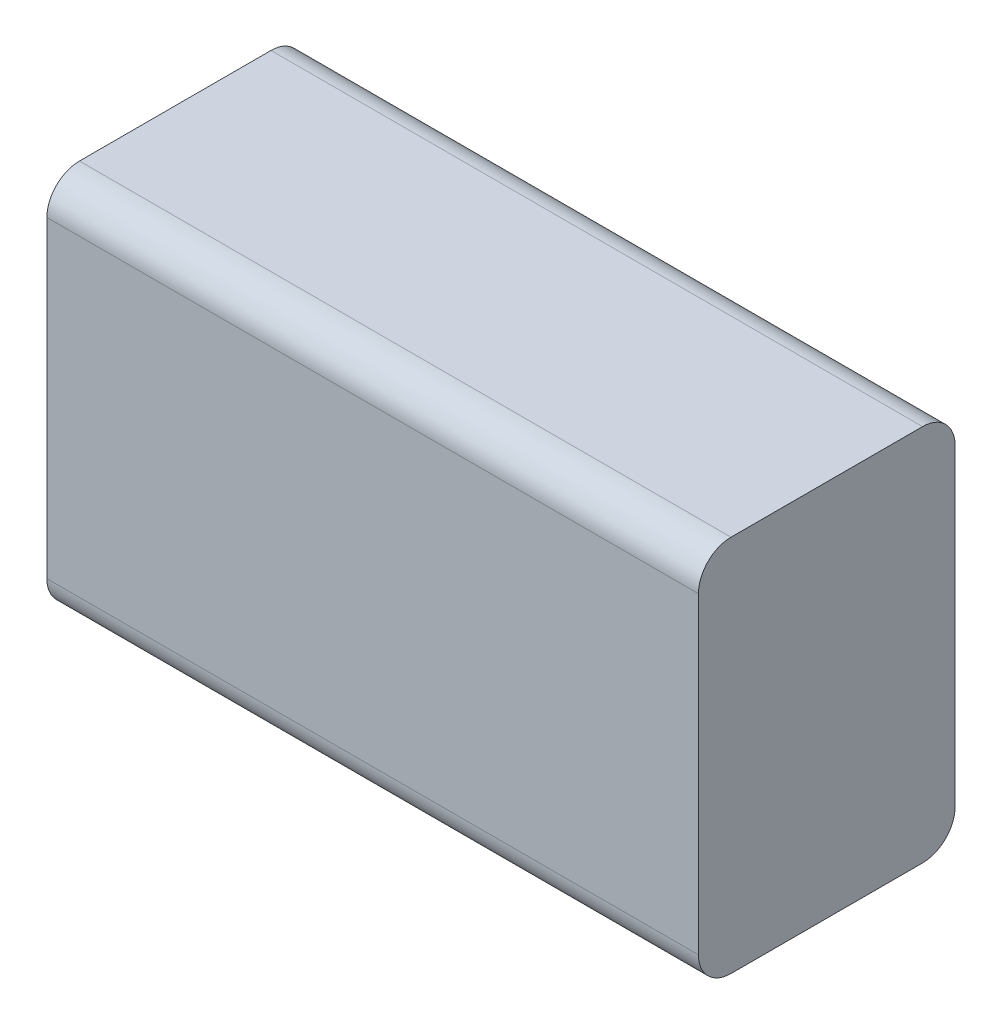
ISO-10303-21;
HEADER;
FILE_DESCRIPTION(('STEP AP214'),'2;1');
FILE_NAME('part.step','',(''),(''),'','','');
FILE_SCHEMA(('AUTOMOTIVE_DESIGN { 1 0 10303 214 1 1 1 1 }'));
ENDSEC;
DATA;
#1=APPLICATION_CONTEXT('core data for automotive mechanical design processes');
#2=APPLICATION_PROTOCOL_DEFINITION('international standard','automotive_design',2000,#1);
#3=PRODUCT_CONTEXT('',#1,'mechanical');
#4=PRODUCT('Part','Part','',(#3));
#5=PRODUCT_RELATED_PRODUCT_CATEGORY('part','',(#4));
#6=PRODUCT_DEFINITION_FORMATION('','',#4);
#7=PRODUCT_DEFINITION_CONTEXT('part definition',#1,'design');
#8=PRODUCT_DEFINITION('design','',#6,#7);
#9=PRODUCT_DEFINITION_SHAPE('','',#8);
#10=(LENGTH_UNIT() NAMED_UNIT(*) SI_UNIT(.MILLI.,.METRE.));
#11=(NAMED_UNIT(*) PLANE_ANGLE_UNIT() SI_UNIT($,.RADIAN.));
#12=(NAMED_UNIT(*) SI_UNIT($,.STERADIAN.) SOLID_ANGLE_UNIT());
#13=UNCERTAINTY_MEASURE_WITH_UNIT(LENGTH_MEASURE(1.E-05),#10,'distance_accuracy_value','');
#14=(GEOMETRIC_REPRESENTATION_CONTEXT(3) GLOBAL_UNCERTAINTY_ASSIGNED_CONTEXT((#13)) GLOBAL_UNIT_ASSIGNED_CONTEXT((#10,
#11,#12)) REPRESENTATION_CONTEXT('',''));
#15=CARTESIAN_POINT('',(0.,0.,0.));
#16=DIRECTION('',(0.,0.,1.));
#17=DIRECTION('',(1.,0.,0.));
#18=AXIS2_PLACEMENT_3D('',#15,#16,#17);
#19=CARTESIAN_POINT('',(-0.25,-0.145,0.1));
#20=DIRECTION('',(1.,0.,0.));
#21=DIRECTION('',(0.,0.,1.));
#22=AXIS2_PLACEMENT_3D('',#19,#20,#21);
#23=PLANE('',#22);
#24=DIRECTION('',(0.,0.,-1.));
#25=VECTOR('',#24,1.);
#26=CARTESIAN_POINT('',(-0.25,0.145,0.1));
#27=LINE('',#26,#25);
#28=CARTESIAN_POINT('',(-0.25,0.145,0.1735));
#29=VERTEX_POINT('',#28);
#30=CARTESIAN_POINT('',(-0.25,0.145,0.0265));
#31=VERTEX_POINT('',#30);
#32=EDGE_CURVE('E42',#29,#31,#27,.T.);
#33=ORIENTED_EDGE('',*,*,#32,.T.);
#34=CARTESIAN_POINT('',(-0.25,0.12,0.0265));
#35=DIRECTION('',(-1.,0.,0.));
#36=DIRECTION('',(0.,0.,-1.));
#37=AXIS2_PLACEMENT_3D('',#34,#35,#36);
#38=CIRCLE('',#37,0.025);
#39=CARTESIAN_POINT('',(-0.25,0.12,0.00149999999999998));
#40=VERTEX_POINT('',#39);
#41=EDGE_CURVE('E164',#31,#40,#38,.T.);
#42=ORIENTED_EDGE('',*,*,#41,.T.);
#43=DIRECTION('',(0.,1.,0.));
#44=VECTOR('',#43,1.);
#45=CARTESIAN_POINT('',(-0.25,-0.145,0.00149999999999998));
#46=LINE('',#45,#44);
#47=CARTESIAN_POINT('',(-0.25,-0.12,0.00149999999999998));
#48=VERTEX_POINT('',#47);
#49=EDGE_CURVE('E28',#48,#40,#46,.T.);
#50=ORIENTED_EDGE('',*,*,#49,.F.);
#51=CARTESIAN_POINT('',(-0.25,-0.12,0.0265));
#52=DIRECTION('',(-1.,0.,0.));
#53=DIRECTION('',(0.,0.,-1.));
#54=AXIS2_PLACEMENT_3D('',#51,#52,#53);
#55=CIRCLE('',#54,0.025);
#56=CARTESIAN_POINT('',(-0.25,-0.145,0.0265));
#57=VERTEX_POINT('',#56);
#58=EDGE_CURVE('E147',#48,#57,#55,.T.);
#59=ORIENTED_EDGE('',*,*,#58,.T.);
#60=DIRECTION('',(0.,0.,-1.));
#61=VECTOR('',#60,1.);
#62=CARTESIAN_POINT('',(-0.25,-0.145,0.1));
#63=LINE('',#62,#61);
#64=CARTESIAN_POINT('',(-0.25,-0.145,0.1735));
#65=VERTEX_POINT('',#64);
#66=EDGE_CURVE('E177',#65,#57,#63,.T.);
#67=ORIENTED_EDGE('',*,*,#66,.F.);
#68=CARTESIAN_POINT('',(-0.25,-0.12,0.1735));
#69=DIRECTION('',(-1.,0.,0.));
#70=DIRECTION('',(0.,0.,-1.));
#71=AXIS2_PLACEMENT_3D('',#68,#69,#70);
#72=CIRCLE('',#71,0.025);
#73=CARTESIAN_POINT('',(-0.25,-0.12,0.1985));
#74=VERTEX_POINT('',#73);
#75=EDGE_CURVE('E134',#65,#74,#72,.T.);
#76=ORIENTED_EDGE('',*,*,#75,.T.);
#77=DIRECTION('',(0.,1.,0.));
#78=VECTOR('',#77,1.);
#79=CARTESIAN_POINT('',(-0.25,-0.145,0.1985));
#80=LINE('',#79,#78);
#81=CARTESIAN_POINT('',(-0.25,0.12,0.1985));
#82=VERTEX_POINT('',#81);
#83=EDGE_CURVE('E126',#74,#82,#80,.T.);
#84=ORIENTED_EDGE('',*,*,#83,.T.);
#85=CARTESIAN_POINT('',(-0.25,0.12,0.1735));
#86=DIRECTION('',(-1.,0.,0.));
#87=DIRECTION('',(0.,0.,-1.));
#88=AXIS2_PLACEMENT_3D('',#85,#86,#87);
#89=CIRCLE('',#88,0.025);
#90=EDGE_CURVE('E167',#82,#29,#89,.T.);
#91=ORIENTED_EDGE('',*,*,#90,.T.);
#92=EDGE_LOOP('',(#33,#42,#50,#59,#67,#76,#84,#91));
#93=FACE_BOUND('',#92,.T.);
#94=ADVANCED_FACE('F17',(#93),#23,.F.);
#95=CARTESIAN_POINT('',(0.25,-0.145,0.1));
#96=DIRECTION('',(1.,0.,0.));
#97=DIRECTION('',(0.,0.,1.));
#98=AXIS2_PLACEMENT_3D('',#95,#96,#97);
#99=PLANE('',#98);
#100=DIRECTION('',(0.,1.,0.));
#101=VECTOR('',#100,1.);
#102=CARTESIAN_POINT('',(0.25,-0.145,0.00150000000000003));
#103=LINE('',#102,#101);
#104=CARTESIAN_POINT('',(0.25,-0.12,0.00150000000000003));
#105=VERTEX_POINT('',#104);
#106=CARTESIAN_POINT('',(0.25,0.12,0.00150000000000003));
#107=VERTEX_POINT('',#106);
#108=EDGE_CURVE('E11',#105,#107,#103,.T.);
#109=ORIENTED_EDGE('',*,*,#108,.T.);
#110=CARTESIAN_POINT('',(0.25,0.12,0.0265));
#111=DIRECTION('',(1.,0.,0.));
#112=DIRECTION('',(0.,0.,-1.));
#113=AXIS2_PLACEMENT_3D('',#110,#111,#112);
#114=CIRCLE('',#113,0.025);
#115=CARTESIAN_POINT('',(0.25,0.145,0.0265));
#116=VERTEX_POINT('',#115);
#117=EDGE_CURVE('E171',#107,#116,#114,.T.);
#118=ORIENTED_EDGE('',*,*,#117,.T.);
#119=DIRECTION('',(0.,0.,-1.));
#120=VECTOR('',#119,1.);
#121=CARTESIAN_POINT('',(0.25,0.145,0.1));
#122=LINE('',#121,#120);
#123=CARTESIAN_POINT('',(0.25,0.145,0.1735));
#124=VERTEX_POINT('',#123);
#125=EDGE_CURVE('E91',#124,#116,#122,.T.);
#126=ORIENTED_EDGE('',*,*,#125,.F.);
#127=CARTESIAN_POINT('',(0.25,0.12,0.1735));
#128=DIRECTION('',(1.,0.,0.));
#129=DIRECTION('',(0.,0.,-1.));
#130=AXIS2_PLACEMENT_3D('',#127,#128,#129);
#131=CIRCLE('',#130,0.025);
#132=CARTESIAN_POINT('',(0.25,0.12,0.1985));
#133=VERTEX_POINT('',#132);
#134=EDGE_CURVE('E124',#124,#133,#131,.T.);
#135=ORIENTED_EDGE('',*,*,#134,.T.);
#136=DIRECTION('',(0.,1.,0.));
#137=VECTOR('',#136,1.);
#138=CARTESIAN_POINT('',(0.25,-0.145,0.1985));
#139=LINE('',#138,#137);
#140=CARTESIAN_POINT('',(0.25,-0.12,0.1985));
#141=VERTEX_POINT('',#140);
#142=EDGE_CURVE('E79',#141,#133,#139,.T.);
#143=ORIENTED_EDGE('',*,*,#142,.F.);
#144=CARTESIAN_POINT('',(0.25,-0.12,0.1735));
#145=DIRECTION('',(1.,0.,0.));
#146=DIRECTION('',(0.,0.,-1.));
#147=AXIS2_PLACEMENT_3D('',#144,#145,#146);
#148=CIRCLE('',#147,0.025);
#149=CARTESIAN_POINT('',(0.25,-0.145,0.1735));
#150=VERTEX_POINT('',#149);
#151=EDGE_CURVE('E122',#141,#150,#148,.T.);
#152=ORIENTED_EDGE('',*,*,#151,.T.);
#153=DIRECTION('',(0.,0.,-1.));
#154=VECTOR('',#153,1.);
#155=CARTESIAN_POINT('',(0.25,-0.145,0.1));
#156=LINE('',#155,#154);
#157=CARTESIAN_POINT('',(0.25,-0.145,0.0265));
#158=VERTEX_POINT('',#157);
#159=EDGE_CURVE('E112',#150,#158,#156,.T.);
#160=ORIENTED_EDGE('',*,*,#159,.T.);
#161=CARTESIAN_POINT('',(0.25,-0.12,0.0265));
#162=DIRECTION('',(1.,0.,0.));
#163=DIRECTION('',(0.,0.,-1.));
#164=AXIS2_PLACEMENT_3D('',#161,#162,#163);
#165=CIRCLE('',#164,0.025);
#166=EDGE_CURVE('E148',#158,#105,#165,.T.);
#167=ORIENTED_EDGE('',*,*,#166,.T.);
#168=EDGE_LOOP('',(#109,#118,#126,#135,#143,#152,#160,#167));
#169=FACE_BOUND('',#168,.T.);
#170=ADVANCED_FACE('F120',(#169),#99,.T.);
#171=CARTESIAN_POINT('',(0.,-0.145,0.0015));
#172=DIRECTION('',(0.,0.,-1.));
#173=DIRECTION('',(0.,-1.,0.));
#174=AXIS2_PLACEMENT_3D('',#171,#172,#173);
#175=PLANE('',#174);
#176=ORIENTED_EDGE('',*,*,#49,.T.);
#177=DIRECTION('',(1.,0.,0.));
#178=VECTOR('',#177,1.);
#179=CARTESIAN_POINT('',(0.,0.12,0.0015));
#180=LINE('',#179,#178);
#181=EDGE_CURVE('E184',#40,#107,#180,.T.);
#182=ORIENTED_EDGE('',*,*,#181,.T.);
#183=ORIENTED_EDGE('',*,*,#108,.F.);
#184=DIRECTION('',(-1.,0.,0.));
#185=VECTOR('',#184,1.);
#186=CARTESIAN_POINT('',(0.,-0.12,0.0015));
#187=LINE('',#186,#185);
#188=EDGE_CURVE('E155',#105,#48,#187,.T.);
#189=ORIENTED_EDGE('',*,*,#188,.T.);
#190=EDGE_LOOP('',(#176,#182,#183,#189));
#191=FACE_BOUND('',#190,.T.);
#192=ADVANCED_FACE('F215',(#191),#175,.T.);
#193=CARTESIAN_POINT('',(0.,-0.145,0.1985));
#194=DIRECTION('',(0.,0.,-1.));
#195=DIRECTION('',(0.,-1.,0.));
#196=AXIS2_PLACEMENT_3D('',#193,#194,#195);
#197=PLANE('',#196);
#198=ORIENTED_EDGE('',*,*,#142,.T.);
#199=DIRECTION('',(-1.,0.,0.));
#200=VECTOR('',#199,1.);
#201=CARTESIAN_POINT('',(-0.25,0.12,0.1985));
#202=LINE('',#201,#200);
#203=EDGE_CURVE('E168',#133,#82,#202,.T.);
#204=ORIENTED_EDGE('',*,*,#203,.T.);
#205=ORIENTED_EDGE('',*,*,#83,.F.);
#206=DIRECTION('',(1.,0.,0.));
#207=VECTOR('',#206,1.);
#208=CARTESIAN_POINT('',(0.25,-0.12,0.1985));
#209=LINE('',#208,#207);
#210=EDGE_CURVE('E21',#74,#141,#209,.T.);
#211=ORIENTED_EDGE('',*,*,#210,.T.);
#212=EDGE_LOOP('',(#198,#204,#205,#211));
#213=FACE_BOUND('',#212,.T.);
#214=ADVANCED_FACE('F129',(#213),#197,.F.);
#215=CARTESIAN_POINT('',(0.,0.145,0.1));
#216=DIRECTION('',(0.,1.,0.));
#217=DIRECTION('',(1.,0.,0.));
#218=AXIS2_PLACEMENT_3D('',#215,#216,#217);
#219=PLANE('',#218);
#220=ORIENTED_EDGE('',*,*,#125,.T.);
#221=DIRECTION('',(-1.,0.,0.));
#222=VECTOR('',#221,1.);
#223=CARTESIAN_POINT('',(0.,0.145,0.0265));
#224=LINE('',#223,#222);
#225=EDGE_CURVE('E172',#116,#31,#224,.T.);
#226=ORIENTED_EDGE('',*,*,#225,.T.);
#227=ORIENTED_EDGE('',*,*,#32,.F.);
#228=DIRECTION('',(1.,0.,0.));
#229=VECTOR('',#228,1.);
#230=CARTESIAN_POINT('',(0.25,0.145,0.1735));
#231=LINE('',#230,#229);
#232=EDGE_CURVE('E165',#29,#124,#231,.T.);
#233=ORIENTED_EDGE('',*,*,#232,.T.);
#234=EDGE_LOOP('',(#220,#226,#227,#233));
#235=FACE_BOUND('',#234,.T.);
#236=ADVANCED_FACE('F204',(#235),#219,.T.);
#237=CARTESIAN_POINT('',(0.,-0.145,0.1));
#238=DIRECTION('',(0.,-1.,0.));
#239=DIRECTION('',(0.,0.,-1.));
#240=AXIS2_PLACEMENT_3D('',#237,#238,#239);
#241=PLANE('',#240);
#242=ORIENTED_EDGE('',*,*,#159,.F.);
#243=DIRECTION('',(-1.,0.,0.));
#244=VECTOR('',#243,1.);
#245=CARTESIAN_POINT('',(-0.25,-0.145,0.1735));
#246=LINE('',#245,#244);
#247=EDGE_CURVE('E138',#150,#65,#246,.T.);
#248=ORIENTED_EDGE('',*,*,#247,.T.);
#249=ORIENTED_EDGE('',*,*,#66,.T.);
#250=DIRECTION('',(1.,0.,0.));
#251=VECTOR('',#250,1.);
#252=CARTESIAN_POINT('',(0.,-0.145,0.0265));
#253=LINE('',#252,#251);
#254=EDGE_CURVE('E146',#57,#158,#253,.T.);
#255=ORIENTED_EDGE('',*,*,#254,.T.);
#256=EDGE_LOOP('',(#242,#248,#249,#255));
#257=FACE_BOUND('',#256,.T.);
#258=ADVANCED_FACE('F232',(#257),#241,.T.);
#259=CARTESIAN_POINT('',(0.,0.12,0.0265));
#260=DIRECTION('',(1.,0.,0.));
#261=DIRECTION('',(0.,0.,1.));
#262=AXIS2_PLACEMENT_3D('',#259,#260,#261);
#263=CYLINDRICAL_SURFACE('',#262,0.025);
#264=ORIENTED_EDGE('',*,*,#117,.F.);
#265=ORIENTED_EDGE('',*,*,#181,.F.);
#266=ORIENTED_EDGE('',*,*,#41,.F.);
#267=ORIENTED_EDGE('',*,*,#225,.F.);
#268=EDGE_LOOP('',(#264,#265,#266,#267));
#269=FACE_BOUND('',#268,.T.);
#270=ADVANCED_FACE('F210',(#269),#263,.T.);
#271=CARTESIAN_POINT('',(0.,0.12,0.1735));
#272=DIRECTION('',(-1.,0.,0.));
#273=DIRECTION('',(0.,0.,-1.));
#274=AXIS2_PLACEMENT_3D('',#271,#272,#273);
#275=CYLINDRICAL_SURFACE('',#274,0.025);
#276=ORIENTED_EDGE('',*,*,#134,.F.);
#277=ORIENTED_EDGE('',*,*,#232,.F.);
#278=ORIENTED_EDGE('',*,*,#90,.F.);
#279=ORIENTED_EDGE('',*,*,#203,.F.);
#280=EDGE_LOOP('',(#276,#277,#278,#279));
#281=FACE_BOUND('',#280,.T.);
#282=ADVANCED_FACE('F19',(#281),#275,.T.);
#283=CARTESIAN_POINT('',(0.,-0.12,0.0265));
#284=DIRECTION('',(1.,0.,0.));
#285=DIRECTION('',(0.,0.,1.));
#286=AXIS2_PLACEMENT_3D('',#283,#284,#285);
#287=CYLINDRICAL_SURFACE('',#286,0.025);
#288=ORIENTED_EDGE('',*,*,#166,.F.);
#289=ORIENTED_EDGE('',*,*,#254,.F.);
#290=ORIENTED_EDGE('',*,*,#58,.F.);
#291=ORIENTED_EDGE('',*,*,#188,.F.);
#292=EDGE_LOOP('',(#288,#289,#290,#291));
#293=FACE_BOUND('',#292,.T.);
#294=ADVANCED_FACE('F217',(#293),#287,.T.);
#295=CARTESIAN_POINT('',(0.,-0.12,0.1735));
#296=DIRECTION('',(-1.,0.,0.));
#297=DIRECTION('',(0.,0.,-1.));
#298=AXIS2_PLACEMENT_3D('',#295,#296,#297);
#299=CYLINDRICAL_SURFACE('',#298,0.025);
#300=ORIENTED_EDGE('',*,*,#151,.F.);
#301=ORIENTED_EDGE('',*,*,#210,.F.);
#302=ORIENTED_EDGE('',*,*,#75,.F.);
#303=ORIENTED_EDGE('',*,*,#247,.F.);
#304=EDGE_LOOP('',(#300,#301,#302,#303));
#305=FACE_BOUND('',#304,.T.);
#306=ADVANCED_FACE('F136',(#305),#299,.T.);
#307=CLOSED_SHELL('',(#94,#170,#192,#214,#236,#258,#270,#282,#294,#306));
#308=MANIFOLD_SOLID_BREP('B1',#307);
#309=ADVANCED_BREP_SHAPE_REPRESENTATION('',(#18,#308),#14);
#310=SHAPE_DEFINITION_REPRESENTATION(#9,#309);
ENDSEC;
END-ISO-10303-21;
